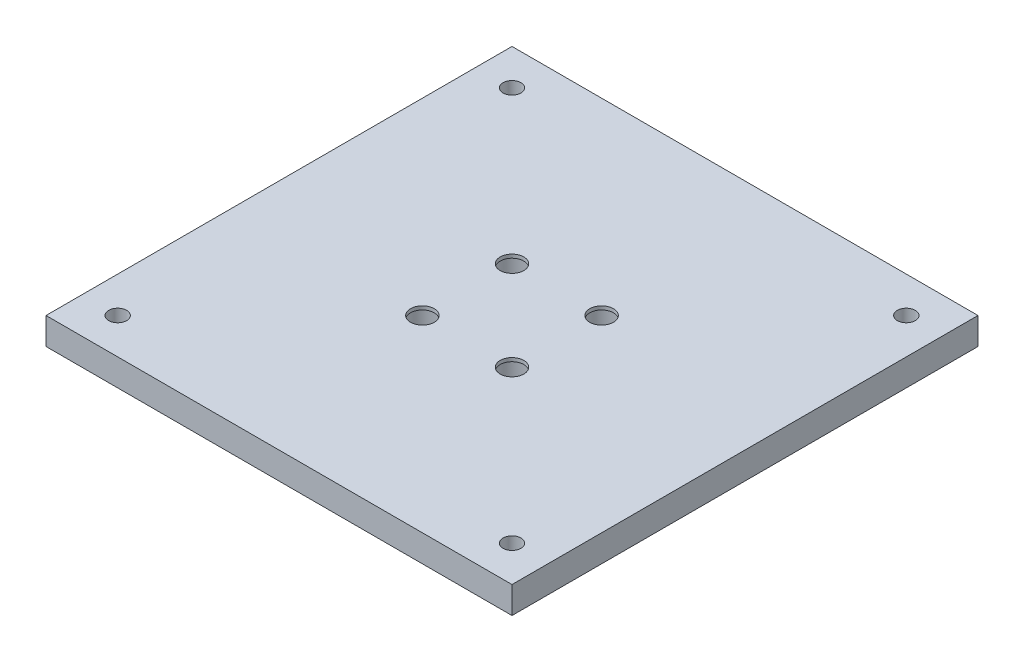
ISO-10303-21;
HEADER;
FILE_DESCRIPTION(('STEP AP214'),'2;1');
FILE_NAME('part.step','',(''),(''),'','','');
FILE_SCHEMA(('AUTOMOTIVE_DESIGN { 1 0 10303 214 1 1 1 1 }'));
ENDSEC;
DATA;
#1=APPLICATION_CONTEXT('core data for automotive mechanical design processes');
#2=APPLICATION_PROTOCOL_DEFINITION('international standard','automotive_design',2000,#1);
#3=PRODUCT_CONTEXT('',#1,'mechanical');
#4=PRODUCT('Part','Part','',(#3));
#5=PRODUCT_RELATED_PRODUCT_CATEGORY('part','',(#4));
#6=PRODUCT_DEFINITION_FORMATION('','',#4);
#7=PRODUCT_DEFINITION_CONTEXT('part definition',#1,'design');
#8=PRODUCT_DEFINITION('design','',#6,#7);
#9=PRODUCT_DEFINITION_SHAPE('','',#8);
#10=(LENGTH_UNIT() NAMED_UNIT(*) SI_UNIT(.MILLI.,.METRE.));
#11=(NAMED_UNIT(*) PLANE_ANGLE_UNIT() SI_UNIT($,.RADIAN.));
#12=(NAMED_UNIT(*) SI_UNIT($,.STERADIAN.) SOLID_ANGLE_UNIT());
#13=UNCERTAINTY_MEASURE_WITH_UNIT(LENGTH_MEASURE(1.E-05),#10,'distance_accuracy_value','');
#14=(GEOMETRIC_REPRESENTATION_CONTEXT(3) GLOBAL_UNCERTAINTY_ASSIGNED_CONTEXT((#13)) GLOBAL_UNIT_ASSIGNED_CONTEXT((#10,
#11,#12)) REPRESENTATION_CONTEXT('',''));
#15=CARTESIAN_POINT('',(0.,0.,0.));
#16=DIRECTION('',(0.,0.,1.));
#17=DIRECTION('',(1.,0.,0.));
#18=AXIS2_PLACEMENT_3D('',#15,#16,#17);
#19=CARTESIAN_POINT('',(0.,7.5,0.));
#20=DIRECTION('',(1.,0.,0.));
#21=DIRECTION('',(0.,0.,-1.));
#22=AXIS2_PLACEMENT_3D('',#19,#20,#21);
#23=PLANE('',#22);
#24=DIRECTION('',(0.,0.,1.));
#25=VECTOR('',#24,1.);
#26=CARTESIAN_POINT('',(0.,0.,0.));
#27=LINE('',#26,#25);
#28=CARTESIAN_POINT('',(0.,0.,-130.));
#29=VERTEX_POINT('',#28);
#30=CARTESIAN_POINT('',(0.,0.,0.));
#31=VERTEX_POINT('',#30);
#32=EDGE_CURVE('E111',#29,#31,#27,.T.);
#33=ORIENTED_EDGE('',*,*,#32,.T.);
#34=DIRECTION('',(0.,-1.,0.));
#35=VECTOR('',#34,1.);
#36=CARTESIAN_POINT('',(0.,7.5,0.));
#37=LINE('',#36,#35);
#38=CARTESIAN_POINT('',(0.,7.5,0.));
#39=VERTEX_POINT('',#38);
#40=EDGE_CURVE('E11',#39,#31,#37,.T.);
#41=ORIENTED_EDGE('',*,*,#40,.F.);
#42=DIRECTION('',(0.,0.,1.));
#43=VECTOR('',#42,1.);
#44=CARTESIAN_POINT('',(0.,7.5,0.));
#45=LINE('',#44,#43);
#46=CARTESIAN_POINT('',(0.,7.5,-130.));
#47=VERTEX_POINT('',#46);
#48=EDGE_CURVE('E95',#47,#39,#45,.T.);
#49=ORIENTED_EDGE('',*,*,#48,.F.);
#50=DIRECTION('',(0.,-1.,0.));
#51=VECTOR('',#50,1.);
#52=CARTESIAN_POINT('',(0.,7.5,-130.));
#53=LINE('',#52,#51);
#54=EDGE_CURVE('E107',#47,#29,#53,.T.);
#55=ORIENTED_EDGE('',*,*,#54,.T.);
#56=EDGE_LOOP('',(#33,#41,#49,#55));
#57=FACE_BOUND('',#56,.T.);
#58=ADVANCED_FACE('F43',(#57),#23,.F.);
#59=CARTESIAN_POINT('',(0.,7.5,0.));
#60=DIRECTION('',(0.,0.,-1.));
#61=DIRECTION('',(-1.,0.,0.));
#62=AXIS2_PLACEMENT_3D('',#59,#60,#61);
#63=PLANE('',#62);
#64=DIRECTION('',(1.,0.,0.));
#65=VECTOR('',#64,1.);
#66=CARTESIAN_POINT('',(0.,0.,0.));
#67=LINE('',#66,#65);
#68=CARTESIAN_POINT('',(130.,0.,0.));
#69=VERTEX_POINT('',#68);
#70=EDGE_CURVE('E100',#31,#69,#67,.T.);
#71=ORIENTED_EDGE('',*,*,#70,.T.);
#72=DIRECTION('',(0.,-1.,0.));
#73=VECTOR('',#72,1.);
#74=CARTESIAN_POINT('',(130.,7.5,0.));
#75=LINE('',#74,#73);
#76=CARTESIAN_POINT('',(130.,7.5,0.));
#77=VERTEX_POINT('',#76);
#78=EDGE_CURVE('E52',#77,#69,#75,.T.);
#79=ORIENTED_EDGE('',*,*,#78,.F.);
#80=DIRECTION('',(1.,0.,0.));
#81=VECTOR('',#80,1.);
#82=CARTESIAN_POINT('',(0.,7.5,0.));
#83=LINE('',#82,#81);
#84=EDGE_CURVE('E90',#39,#77,#83,.T.);
#85=ORIENTED_EDGE('',*,*,#84,.F.);
#86=ORIENTED_EDGE('',*,*,#40,.T.);
#87=EDGE_LOOP('',(#71,#79,#85,#86));
#88=FACE_BOUND('',#87,.T.);
#89=ADVANCED_FACE('F99',(#88),#63,.F.);
#90=CARTESIAN_POINT('',(130.,7.5,0.));
#91=DIRECTION('',(-1.,0.,0.));
#92=DIRECTION('',(0.,0.,1.));
#93=AXIS2_PLACEMENT_3D('',#90,#91,#92);
#94=PLANE('',#93);
#95=DIRECTION('',(0.,0.,-1.));
#96=VECTOR('',#95,1.);
#97=CARTESIAN_POINT('',(130.,0.,0.));
#98=LINE('',#97,#96);
#99=CARTESIAN_POINT('',(130.,0.,-130.));
#100=VERTEX_POINT('',#99);
#101=EDGE_CURVE('E77',#69,#100,#98,.T.);
#102=ORIENTED_EDGE('',*,*,#101,.T.);
#103=DIRECTION('',(0.,-1.,0.));
#104=VECTOR('',#103,1.);
#105=CARTESIAN_POINT('',(130.,7.5,-130.));
#106=LINE('',#105,#104);
#107=CARTESIAN_POINT('',(130.,7.5,-130.));
#108=VERTEX_POINT('',#107);
#109=EDGE_CURVE('E102',#108,#100,#106,.T.);
#110=ORIENTED_EDGE('',*,*,#109,.F.);
#111=DIRECTION('',(0.,0.,-1.));
#112=VECTOR('',#111,1.);
#113=CARTESIAN_POINT('',(130.,7.5,0.));
#114=LINE('',#113,#112);
#115=EDGE_CURVE('E93',#77,#108,#114,.T.);
#116=ORIENTED_EDGE('',*,*,#115,.F.);
#117=ORIENTED_EDGE('',*,*,#78,.T.);
#118=EDGE_LOOP('',(#102,#110,#116,#117));
#119=FACE_BOUND('',#118,.T.);
#120=ADVANCED_FACE('F103',(#119),#94,.F.);
#121=CARTESIAN_POINT('',(0.,7.5,-130.));
#122=DIRECTION('',(0.,0.,1.));
#123=DIRECTION('',(1.,0.,0.));
#124=AXIS2_PLACEMENT_3D('',#121,#122,#123);
#125=PLANE('',#124);
#126=DIRECTION('',(-1.,0.,0.));
#127=VECTOR('',#126,1.);
#128=CARTESIAN_POINT('',(0.,0.,-130.));
#129=LINE('',#128,#127);
#130=EDGE_CURVE('E83',#100,#29,#129,.T.);
#131=ORIENTED_EDGE('',*,*,#130,.T.);
#132=ORIENTED_EDGE('',*,*,#54,.F.);
#133=DIRECTION('',(-1.,0.,0.));
#134=VECTOR('',#133,1.);
#135=CARTESIAN_POINT('',(0.,7.5,-130.));
#136=LINE('',#135,#134);
#137=EDGE_CURVE('E60',#108,#47,#136,.T.);
#138=ORIENTED_EDGE('',*,*,#137,.F.);
#139=ORIENTED_EDGE('',*,*,#109,.T.);
#140=EDGE_LOOP('',(#131,#132,#138,#139));
#141=FACE_BOUND('',#140,.T.);
#142=ADVANCED_FACE('F125',(#141),#125,.F.);
#143=CARTESIAN_POINT('',(0.,7.5,0.));
#144=DIRECTION('',(0.,-1.,0.));
#145=DIRECTION('',(0.,0.,-1.));
#146=AXIS2_PLACEMENT_3D('',#143,#144,#145);
#147=PLANE('',#146);
#148=CARTESIAN_POINT('',(52.5,7.5,-77.5));
#149=DIRECTION('',(0.,-1.,0.));
#150=DIRECTION('',(0.,0.,-1.));
#151=AXIS2_PLACEMENT_3D('',#148,#149,#150);
#152=CIRCLE('',#151,3.3);
#153=CARTESIAN_POINT('',(52.5,7.5,-80.8));
#154=VERTEX_POINT('',#153);
#155=EDGE_CURVE('E208',#154,#154,#152,.T.);
#156=ORIENTED_EDGE('',*,*,#155,.T.);
#157=EDGE_LOOP('',(#156));
#158=FACE_BOUND('',#157,.T.);
#159=CARTESIAN_POINT('',(77.5,7.5,-77.5));
#160=DIRECTION('',(0.,-1.,0.));
#161=DIRECTION('',(0.,0.,-1.));
#162=AXIS2_PLACEMENT_3D('',#159,#160,#161);
#163=CIRCLE('',#162,3.29999999999999);
#164=CARTESIAN_POINT('',(77.5,7.5,-80.8));
#165=VERTEX_POINT('',#164);
#166=EDGE_CURVE('E216',#165,#165,#163,.T.);
#167=ORIENTED_EDGE('',*,*,#166,.T.);
#168=EDGE_LOOP('',(#167));
#169=FACE_BOUND('',#168,.T.);
#170=CARTESIAN_POINT('',(77.5,7.5,-52.5));
#171=DIRECTION('',(0.,-1.,0.));
#172=DIRECTION('',(0.,0.,-1.));
#173=AXIS2_PLACEMENT_3D('',#170,#171,#172);
#174=CIRCLE('',#173,3.29999999999999);
#175=CARTESIAN_POINT('',(77.5,7.5,-55.8));
#176=VERTEX_POINT('',#175);
#177=EDGE_CURVE('E200',#176,#176,#174,.T.);
#178=ORIENTED_EDGE('',*,*,#177,.T.);
#179=EDGE_LOOP('',(#178));
#180=FACE_BOUND('',#179,.T.);
#181=CARTESIAN_POINT('',(52.5,7.5,-52.5));
#182=DIRECTION('',(0.,-1.,0.));
#183=DIRECTION('',(0.,0.,-1.));
#184=AXIS2_PLACEMENT_3D('',#181,#182,#183);
#185=CIRCLE('',#184,3.3);
#186=CARTESIAN_POINT('',(52.5,7.5,-55.8));
#187=VERTEX_POINT('',#186);
#188=EDGE_CURVE('E192',#187,#187,#185,.T.);
#189=ORIENTED_EDGE('',*,*,#188,.T.);
#190=EDGE_LOOP('',(#189));
#191=FACE_BOUND('',#190,.T.);
#192=CARTESIAN_POINT('',(10.,7.5,-120.));
#193=DIRECTION('',(0.,1.,0.));
#194=DIRECTION('',(0.,0.,1.));
#195=AXIS2_PLACEMENT_3D('',#192,#193,#194);
#196=CIRCLE('',#195,2.49999999999999);
#197=CARTESIAN_POINT('',(10.,7.5,-117.5));
#198=VERTEX_POINT('',#197);
#199=EDGE_CURVE('E159',#198,#198,#196,.T.);
#200=ORIENTED_EDGE('',*,*,#199,.F.);
#201=EDGE_LOOP('',(#200));
#202=FACE_BOUND('',#201,.T.);
#203=CARTESIAN_POINT('',(120.,7.5,-120.));
#204=DIRECTION('',(0.,1.,0.));
#205=DIRECTION('',(0.,0.,1.));
#206=AXIS2_PLACEMENT_3D('',#203,#204,#205);
#207=CIRCLE('',#206,2.49999999999999);
#208=CARTESIAN_POINT('',(120.,7.5,-117.5));
#209=VERTEX_POINT('',#208);
#210=EDGE_CURVE('E151',#209,#209,#207,.T.);
#211=ORIENTED_EDGE('',*,*,#210,.F.);
#212=EDGE_LOOP('',(#211));
#213=FACE_BOUND('',#212,.T.);
#214=CARTESIAN_POINT('',(120.,7.5,-10.));
#215=DIRECTION('',(0.,1.,0.));
#216=DIRECTION('',(0.,0.,1.));
#217=AXIS2_PLACEMENT_3D('',#214,#215,#216);
#218=CIRCLE('',#217,2.49999999999999);
#219=CARTESIAN_POINT('',(120.,7.5,-7.50000000000001));
#220=VERTEX_POINT('',#219);
#221=EDGE_CURVE('E143',#220,#220,#218,.T.);
#222=ORIENTED_EDGE('',*,*,#221,.F.);
#223=EDGE_LOOP('',(#222));
#224=FACE_BOUND('',#223,.T.);
#225=CARTESIAN_POINT('',(9.99999999999999,7.5,-9.99999999999999));
#226=DIRECTION('',(0.,1.,0.));
#227=DIRECTION('',(0.,0.,1.));
#228=AXIS2_PLACEMENT_3D('',#225,#226,#227);
#229=CIRCLE('',#228,2.49999999999999);
#230=CARTESIAN_POINT('',(9.99999999999999,7.5,-7.50000000000001));
#231=VERTEX_POINT('',#230);
#232=EDGE_CURVE('E135',#231,#231,#229,.T.);
#233=ORIENTED_EDGE('',*,*,#232,.F.);
#234=EDGE_LOOP('',(#233));
#235=FACE_BOUND('',#234,.T.);
#236=ORIENTED_EDGE('',*,*,#48,.T.);
#237=ORIENTED_EDGE('',*,*,#84,.T.);
#238=ORIENTED_EDGE('',*,*,#115,.T.);
#239=ORIENTED_EDGE('',*,*,#137,.T.);
#240=EDGE_LOOP('',(#236,#237,#238,#239));
#241=FACE_BOUND('',#240,.T.);
#242=ADVANCED_FACE('F91',(#158,#169,#180,#191,#202,#213,#224,#235,#241),#147,.F.);
#243=CARTESIAN_POINT('',(0.,0.,0.));
#244=DIRECTION('',(0.,-1.,0.));
#245=DIRECTION('',(0.,0.,-1.));
#246=AXIS2_PLACEMENT_3D('',#243,#244,#245);
#247=PLANE('',#246);
#248=CARTESIAN_POINT('',(77.5,0.,-52.5));
#249=DIRECTION('',(0.,-1.,0.));
#250=DIRECTION('',(0.,0.,-1.));
#251=AXIS2_PLACEMENT_3D('',#248,#249,#250);
#252=CIRCLE('',#251,5.40000000000001);
#253=CARTESIAN_POINT('',(77.5,0.,-57.9));
#254=VERTEX_POINT('',#253);
#255=EDGE_CURVE('E181',#254,#254,#252,.T.);
#256=ORIENTED_EDGE('',*,*,#255,.F.);
#257=EDGE_LOOP('',(#256));
#258=FACE_BOUND('',#257,.T.);
#259=CARTESIAN_POINT('',(52.5,0.,-77.5));
#260=DIRECTION('',(0.,-1.,0.));
#261=DIRECTION('',(0.,0.,-1.));
#262=AXIS2_PLACEMENT_3D('',#259,#260,#261);
#263=CIRCLE('',#262,5.4);
#264=CARTESIAN_POINT('',(52.5,0.,-82.9));
#265=VERTEX_POINT('',#264);
#266=EDGE_CURVE('E172',#265,#265,#263,.T.);
#267=ORIENTED_EDGE('',*,*,#266,.F.);
#268=EDGE_LOOP('',(#267));
#269=FACE_BOUND('',#268,.T.);
#270=CARTESIAN_POINT('',(77.5,0.,-77.5));
#271=DIRECTION('',(0.,-1.,0.));
#272=DIRECTION('',(0.,0.,-1.));
#273=AXIS2_PLACEMENT_3D('',#270,#271,#272);
#274=CIRCLE('',#273,5.40000000000001);
#275=CARTESIAN_POINT('',(77.5,0.,-82.9));
#276=VERTEX_POINT('',#275);
#277=EDGE_CURVE('E188',#276,#276,#274,.T.);
#278=ORIENTED_EDGE('',*,*,#277,.F.);
#279=EDGE_LOOP('',(#278));
#280=FACE_BOUND('',#279,.T.);
#281=CARTESIAN_POINT('',(52.5,0.,-52.5));
#282=DIRECTION('',(0.,-1.,0.));
#283=DIRECTION('',(0.,0.,-1.));
#284=AXIS2_PLACEMENT_3D('',#281,#282,#283);
#285=CIRCLE('',#284,5.4);
#286=CARTESIAN_POINT('',(52.5,0.,-57.9));
#287=VERTEX_POINT('',#286);
#288=EDGE_CURVE('E164',#287,#287,#285,.T.);
#289=ORIENTED_EDGE('',*,*,#288,.F.);
#290=EDGE_LOOP('',(#289));
#291=FACE_BOUND('',#290,.T.);
#292=CARTESIAN_POINT('',(10.,0.,-120.));
#293=DIRECTION('',(0.,1.,0.));
#294=DIRECTION('',(0.,0.,1.));
#295=AXIS2_PLACEMENT_3D('',#292,#293,#294);
#296=CIRCLE('',#295,2.5);
#297=CARTESIAN_POINT('',(10.,0.,-117.5));
#298=VERTEX_POINT('',#297);
#299=EDGE_CURVE('E155',#298,#298,#296,.T.);
#300=ORIENTED_EDGE('',*,*,#299,.T.);
#301=EDGE_LOOP('',(#300));
#302=FACE_BOUND('',#301,.T.);
#303=CARTESIAN_POINT('',(120.,0.,-120.));
#304=DIRECTION('',(0.,1.,0.));
#305=DIRECTION('',(0.,0.,1.));
#306=AXIS2_PLACEMENT_3D('',#303,#304,#305);
#307=CIRCLE('',#306,2.5);
#308=CARTESIAN_POINT('',(120.,0.,-117.5));
#309=VERTEX_POINT('',#308);
#310=EDGE_CURVE('E147',#309,#309,#307,.T.);
#311=ORIENTED_EDGE('',*,*,#310,.T.);
#312=EDGE_LOOP('',(#311));
#313=FACE_BOUND('',#312,.T.);
#314=CARTESIAN_POINT('',(120.,0.,-10.));
#315=DIRECTION('',(0.,1.,0.));
#316=DIRECTION('',(0.,0.,1.));
#317=AXIS2_PLACEMENT_3D('',#314,#315,#316);
#318=CIRCLE('',#317,2.5);
#319=CARTESIAN_POINT('',(120.,0.,-7.5));
#320=VERTEX_POINT('',#319);
#321=EDGE_CURVE('E139',#320,#320,#318,.T.);
#322=ORIENTED_EDGE('',*,*,#321,.T.);
#323=EDGE_LOOP('',(#322));
#324=FACE_BOUND('',#323,.T.);
#325=CARTESIAN_POINT('',(9.99999999999999,0.,-9.99999999999999));
#326=DIRECTION('',(0.,1.,0.));
#327=DIRECTION('',(0.,0.,1.));
#328=AXIS2_PLACEMENT_3D('',#325,#326,#327);
#329=CIRCLE('',#328,2.5);
#330=CARTESIAN_POINT('',(9.99999999999999,0.,-7.5));
#331=VERTEX_POINT('',#330);
#332=EDGE_CURVE('E115',#331,#331,#329,.T.);
#333=ORIENTED_EDGE('',*,*,#332,.T.);
#334=EDGE_LOOP('',(#333));
#335=FACE_BOUND('',#334,.T.);
#336=ORIENTED_EDGE('',*,*,#32,.F.);
#337=ORIENTED_EDGE('',*,*,#130,.F.);
#338=ORIENTED_EDGE('',*,*,#101,.F.);
#339=ORIENTED_EDGE('',*,*,#70,.F.);
#340=EDGE_LOOP('',(#336,#337,#338,#339));
#341=FACE_BOUND('',#340,.T.);
#342=ADVANCED_FACE('F128',(#258,#269,#280,#291,#302,#313,#324,#335,#341),#247,.T.);
#343=CARTESIAN_POINT('',(9.99999999999999,7.5,-9.99999999999999));
#344=DIRECTION('',(0.,1.,0.));
#345=DIRECTION('',(0.,0.,1.));
#346=AXIS2_PLACEMENT_3D('',#343,#344,#345);
#347=CYLINDRICAL_SURFACE('',#346,2.49999999999999);
#348=ORIENTED_EDGE('',*,*,#332,.F.);
#349=EDGE_LOOP('',(#348));
#350=FACE_BOUND('',#349,.T.);
#351=ORIENTED_EDGE('',*,*,#232,.T.);
#352=EDGE_LOOP('',(#351));
#353=FACE_BOUND('',#352,.T.);
#354=ADVANCED_FACE('F253',(#350,#353),#347,.F.);
#355=CARTESIAN_POINT('',(120.,7.5,-10.));
#356=DIRECTION('',(0.,1.,0.));
#357=DIRECTION('',(0.,0.,1.));
#358=AXIS2_PLACEMENT_3D('',#355,#356,#357);
#359=CYLINDRICAL_SURFACE('',#358,2.5);
#360=ORIENTED_EDGE('',*,*,#321,.F.);
#361=EDGE_LOOP('',(#360));
#362=FACE_BOUND('',#361,.T.);
#363=ORIENTED_EDGE('',*,*,#221,.T.);
#364=EDGE_LOOP('',(#363));
#365=FACE_BOUND('',#364,.T.);
#366=ADVANCED_FACE('F271',(#362,#365),#359,.F.);
#367=CARTESIAN_POINT('',(120.,7.5,-120.));
#368=DIRECTION('',(0.,1.,0.));
#369=DIRECTION('',(0.,0.,1.));
#370=AXIS2_PLACEMENT_3D('',#367,#368,#369);
#371=CYLINDRICAL_SURFACE('',#370,2.5);
#372=ORIENTED_EDGE('',*,*,#310,.F.);
#373=EDGE_LOOP('',(#372));
#374=FACE_BOUND('',#373,.T.);
#375=ORIENTED_EDGE('',*,*,#210,.T.);
#376=EDGE_LOOP('',(#375));
#377=FACE_BOUND('',#376,.T.);
#378=ADVANCED_FACE('F317',(#374,#377),#371,.F.);
#379=CARTESIAN_POINT('',(10.,7.5,-120.));
#380=DIRECTION('',(0.,1.,0.));
#381=DIRECTION('',(0.,0.,1.));
#382=AXIS2_PLACEMENT_3D('',#379,#380,#381);
#383=CYLINDRICAL_SURFACE('',#382,2.49999999999999);
#384=ORIENTED_EDGE('',*,*,#299,.F.);
#385=EDGE_LOOP('',(#384));
#386=FACE_BOUND('',#385,.T.);
#387=ORIENTED_EDGE('',*,*,#199,.T.);
#388=EDGE_LOOP('',(#387));
#389=FACE_BOUND('',#388,.T.);
#390=ADVANCED_FACE('F329',(#386,#389),#383,.F.);
#391=CARTESIAN_POINT('',(52.5,6.5,-52.5));
#392=DIRECTION('',(0.,-1.,0.));
#393=DIRECTION('',(0.,0.,-1.));
#394=AXIS2_PLACEMENT_3D('',#391,#392,#393);
#395=CYLINDRICAL_SURFACE('',#394,5.4);
#396=CARTESIAN_POINT('',(52.5,6.5,-52.5));
#397=DIRECTION('',(0.,-1.,0.));
#398=DIRECTION('',(0.,0.,-1.));
#399=AXIS2_PLACEMENT_3D('',#396,#397,#398);
#400=CIRCLE('',#399,5.4);
#401=CARTESIAN_POINT('',(52.5,6.5,-57.9));
#402=VERTEX_POINT('',#401);
#403=EDGE_CURVE('E163',#402,#402,#400,.T.);
#404=ORIENTED_EDGE('',*,*,#403,.F.);
#405=EDGE_LOOP('',(#404));
#406=FACE_BOUND('',#405,.T.);
#407=ORIENTED_EDGE('',*,*,#288,.T.);
#408=EDGE_LOOP('',(#407));
#409=FACE_BOUND('',#408,.T.);
#410=ADVANCED_FACE('F341',(#406,#409),#395,.F.);
#411=CARTESIAN_POINT('',(52.5,6.5,-52.5));
#412=DIRECTION('',(0.,-1.,0.));
#413=DIRECTION('',(0.,0.,-1.));
#414=AXIS2_PLACEMENT_3D('',#411,#412,#413);
#415=PLANE('',#414);
#416=CARTESIAN_POINT('',(52.5,6.5,-52.5));
#417=DIRECTION('',(0.,-1.,0.));
#418=DIRECTION('',(0.,0.,-1.));
#419=AXIS2_PLACEMENT_3D('',#416,#417,#418);
#420=CIRCLE('',#419,3.3);
#421=CARTESIAN_POINT('',(52.5,6.5,-55.8));
#422=VERTEX_POINT('',#421);
#423=EDGE_CURVE('E196',#422,#422,#420,.T.);
#424=ORIENTED_EDGE('',*,*,#423,.F.);
#425=EDGE_LOOP('',(#424));
#426=FACE_BOUND('',#425,.T.);
#427=ORIENTED_EDGE('',*,*,#403,.T.);
#428=EDGE_LOOP('',(#427));
#429=FACE_BOUND('',#428,.T.);
#430=ADVANCED_FACE('F357',(#426,#429),#415,.T.);
#431=CARTESIAN_POINT('',(77.5,6.5,-77.5));
#432=DIRECTION('',(0.,-1.,0.));
#433=DIRECTION('',(0.,0.,-1.));
#434=AXIS2_PLACEMENT_3D('',#431,#432,#433);
#435=CYLINDRICAL_SURFACE('',#434,5.40000000000001);
#436=CARTESIAN_POINT('',(77.5,6.5,-77.5));
#437=DIRECTION('',(0.,-1.,0.));
#438=DIRECTION('',(0.,0.,-1.));
#439=AXIS2_PLACEMENT_3D('',#436,#437,#438);
#440=CIRCLE('',#439,5.40000000000001);
#441=CARTESIAN_POINT('',(77.5,6.5,-82.9));
#442=VERTEX_POINT('',#441);
#443=EDGE_CURVE('E177',#442,#442,#440,.T.);
#444=ORIENTED_EDGE('',*,*,#443,.F.);
#445=EDGE_LOOP('',(#444));
#446=FACE_BOUND('',#445,.T.);
#447=ORIENTED_EDGE('',*,*,#277,.T.);
#448=EDGE_LOOP('',(#447));
#449=FACE_BOUND('',#448,.T.);
#450=ADVANCED_FACE('F365',(#446,#449),#435,.F.);
#451=CARTESIAN_POINT('',(77.5,6.5,-77.5));
#452=DIRECTION('',(0.,-1.,0.));
#453=DIRECTION('',(0.,0.,-1.));
#454=AXIS2_PLACEMENT_3D('',#451,#452,#453);
#455=PLANE('',#454);
#456=CARTESIAN_POINT('',(77.5,6.5,-77.5));
#457=DIRECTION('',(0.,-1.,0.));
#458=DIRECTION('',(0.,0.,-1.));
#459=AXIS2_PLACEMENT_3D('',#456,#457,#458);
#460=CIRCLE('',#459,3.29999999999999);
#461=CARTESIAN_POINT('',(77.5,6.5,-80.8));
#462=VERTEX_POINT('',#461);
#463=EDGE_CURVE('E212',#462,#462,#460,.T.);
#464=ORIENTED_EDGE('',*,*,#463,.F.);
#465=EDGE_LOOP('',(#464));
#466=FACE_BOUND('',#465,.T.);
#467=ORIENTED_EDGE('',*,*,#443,.T.);
#468=EDGE_LOOP('',(#467));
#469=FACE_BOUND('',#468,.T.);
#470=ADVANCED_FACE('F370',(#466,#469),#455,.T.);
#471=CARTESIAN_POINT('',(52.5,6.5,-77.5));
#472=DIRECTION('',(0.,-1.,0.));
#473=DIRECTION('',(0.,0.,-1.));
#474=AXIS2_PLACEMENT_3D('',#471,#472,#473);
#475=CYLINDRICAL_SURFACE('',#474,5.4);
#476=CARTESIAN_POINT('',(52.5,6.5,-77.5));
#477=DIRECTION('',(0.,-1.,0.));
#478=DIRECTION('',(0.,0.,-1.));
#479=AXIS2_PLACEMENT_3D('',#476,#477,#478);
#480=CIRCLE('',#479,5.4);
#481=CARTESIAN_POINT('',(52.5,6.5,-82.9));
#482=VERTEX_POINT('',#481);
#483=EDGE_CURVE('E176',#482,#482,#480,.T.);
#484=ORIENTED_EDGE('',*,*,#483,.F.);
#485=EDGE_LOOP('',(#484));
#486=FACE_BOUND('',#485,.T.);
#487=ORIENTED_EDGE('',*,*,#266,.T.);
#488=EDGE_LOOP('',(#487));
#489=FACE_BOUND('',#488,.T.);
#490=ADVANCED_FACE('F378',(#486,#489),#475,.F.);
#491=CARTESIAN_POINT('',(52.5,6.5,-77.5));
#492=DIRECTION('',(0.,-1.,0.));
#493=DIRECTION('',(0.,0.,-1.));
#494=AXIS2_PLACEMENT_3D('',#491,#492,#493);
#495=PLANE('',#494);
#496=CARTESIAN_POINT('',(52.5,6.5,-77.5));
#497=DIRECTION('',(0.,-1.,0.));
#498=DIRECTION('',(0.,0.,-1.));
#499=AXIS2_PLACEMENT_3D('',#496,#497,#498);
#500=CIRCLE('',#499,3.3);
#501=CARTESIAN_POINT('',(52.5,6.5,-80.8));
#502=VERTEX_POINT('',#501);
#503=EDGE_CURVE('E204',#502,#502,#500,.T.);
#504=ORIENTED_EDGE('',*,*,#503,.F.);
#505=EDGE_LOOP('',(#504));
#506=FACE_BOUND('',#505,.T.);
#507=ORIENTED_EDGE('',*,*,#483,.T.);
#508=EDGE_LOOP('',(#507));
#509=FACE_BOUND('',#508,.T.);
#510=ADVANCED_FACE('F247',(#506,#509),#495,.T.);
#511=CARTESIAN_POINT('',(77.5,6.5,-52.5));
#512=DIRECTION('',(0.,-1.,0.));
#513=DIRECTION('',(0.,0.,-1.));
#514=AXIS2_PLACEMENT_3D('',#511,#512,#513);
#515=CYLINDRICAL_SURFACE('',#514,5.40000000000001);
#516=CARTESIAN_POINT('',(77.5,6.5,-52.5));
#517=DIRECTION('',(0.,-1.,0.));
#518=DIRECTION('',(0.,0.,-1.));
#519=AXIS2_PLACEMENT_3D('',#516,#517,#518);
#520=CIRCLE('',#519,5.40000000000001);
#521=CARTESIAN_POINT('',(77.5,6.5,-57.9));
#522=VERTEX_POINT('',#521);
#523=EDGE_CURVE('E168',#522,#522,#520,.T.);
#524=ORIENTED_EDGE('',*,*,#523,.F.);
#525=EDGE_LOOP('',(#524));
#526=FACE_BOUND('',#525,.T.);
#527=ORIENTED_EDGE('',*,*,#255,.T.);
#528=EDGE_LOOP('',(#527));
#529=FACE_BOUND('',#528,.T.);
#530=ADVANCED_FACE('F241',(#526,#529),#515,.F.);
#531=CARTESIAN_POINT('',(77.5,6.5,-52.5));
#532=DIRECTION('',(0.,-1.,0.));
#533=DIRECTION('',(0.,0.,-1.));
#534=AXIS2_PLACEMENT_3D('',#531,#532,#533);
#535=PLANE('',#534);
#536=CARTESIAN_POINT('',(77.5,6.5,-52.5));
#537=DIRECTION('',(0.,-1.,0.));
#538=DIRECTION('',(0.,0.,-1.));
#539=AXIS2_PLACEMENT_3D('',#536,#537,#538);
#540=CIRCLE('',#539,3.29999999999999);
#541=CARTESIAN_POINT('',(77.5,6.5,-55.8));
#542=VERTEX_POINT('',#541);
#543=EDGE_CURVE('E220',#542,#542,#540,.T.);
#544=ORIENTED_EDGE('',*,*,#543,.F.);
#545=EDGE_LOOP('',(#544));
#546=FACE_BOUND('',#545,.T.);
#547=ORIENTED_EDGE('',*,*,#523,.T.);
#548=EDGE_LOOP('',(#547));
#549=FACE_BOUND('',#548,.T.);
#550=ADVANCED_FACE('F238',(#546,#549),#535,.T.);
#551=CARTESIAN_POINT('',(52.5,7.5,-52.5));
#552=DIRECTION('',(0.,-1.,0.));
#553=DIRECTION('',(0.,0.,-1.));
#554=AXIS2_PLACEMENT_3D('',#551,#552,#553);
#555=CYLINDRICAL_SURFACE('',#554,3.3);
#556=ORIENTED_EDGE('',*,*,#188,.F.);
#557=EDGE_LOOP('',(#556));
#558=FACE_BOUND('',#557,.T.);
#559=ORIENTED_EDGE('',*,*,#423,.T.);
#560=EDGE_LOOP('',(#559));
#561=FACE_BOUND('',#560,.T.);
#562=ADVANCED_FACE('F234',(#558,#561),#555,.F.);
#563=CARTESIAN_POINT('',(77.5,7.5,-52.5));
#564=DIRECTION('',(0.,-1.,0.));
#565=DIRECTION('',(0.,0.,-1.));
#566=AXIS2_PLACEMENT_3D('',#563,#564,#565);
#567=CYLINDRICAL_SURFACE('',#566,3.29999999999999);
#568=ORIENTED_EDGE('',*,*,#177,.F.);
#569=EDGE_LOOP('',(#568));
#570=FACE_BOUND('',#569,.T.);
#571=ORIENTED_EDGE('',*,*,#543,.T.);
#572=EDGE_LOOP('',(#571));
#573=FACE_BOUND('',#572,.T.);
#574=ADVANCED_FACE('F230',(#570,#573),#567,.F.);
#575=CARTESIAN_POINT('',(77.5,7.5,-77.5));
#576=DIRECTION('',(0.,-1.,0.));
#577=DIRECTION('',(0.,0.,-1.));
#578=AXIS2_PLACEMENT_3D('',#575,#576,#577);
#579=CYLINDRICAL_SURFACE('',#578,3.29999999999999);
#580=ORIENTED_EDGE('',*,*,#166,.F.);
#581=EDGE_LOOP('',(#580));
#582=FACE_BOUND('',#581,.T.);
#583=ORIENTED_EDGE('',*,*,#463,.T.);
#584=EDGE_LOOP('',(#583));
#585=FACE_BOUND('',#584,.T.);
#586=ADVANCED_FACE('F233',(#582,#585),#579,.F.);
#587=CARTESIAN_POINT('',(52.5,7.5,-77.5));
#588=DIRECTION('',(0.,-1.,0.));
#589=DIRECTION('',(0.,0.,-1.));
#590=AXIS2_PLACEMENT_3D('',#587,#588,#589);
#591=CYLINDRICAL_SURFACE('',#590,3.3);
#592=ORIENTED_EDGE('',*,*,#155,.F.);
#593=EDGE_LOOP('',(#592));
#594=FACE_BOUND('',#593,.T.);
#595=ORIENTED_EDGE('',*,*,#503,.T.);
#596=EDGE_LOOP('',(#595));
#597=FACE_BOUND('',#596,.T.);
#598=ADVANCED_FACE('F447',(#594,#597),#591,.F.);
#599=CLOSED_SHELL('',(#58,#89,#120,#142,#242,#342,#354,#366,#378,#390,#410,#430,#450,#470,#490,
#510,#530,#550,#562,#574,#586,#598));
#600=MANIFOLD_SOLID_BREP('B2',#599);
#601=ADVANCED_BREP_SHAPE_REPRESENTATION('',(#18,#600),#14);
#602=SHAPE_DEFINITION_REPRESENTATION(#9,#601);
ENDSEC;
END-ISO-10303-21;
